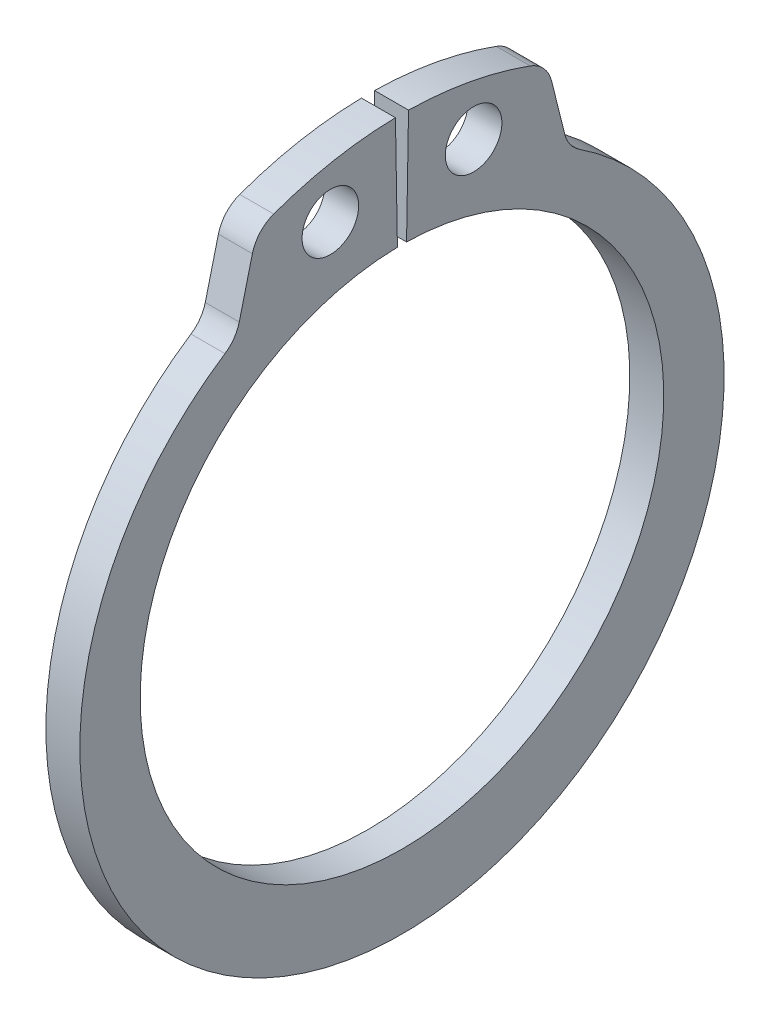
ISO-10303-21;
HEADER;
FILE_DESCRIPTION(('STEP AP214'),'2;1');
FILE_NAME('part.step','',(''),(''),'','','');
FILE_SCHEMA(('AUTOMOTIVE_DESIGN { 1 0 10303 214 1 1 1 1 }'));
ENDSEC;
DATA;
#1=APPLICATION_CONTEXT('core data for automotive mechanical design processes');
#2=APPLICATION_PROTOCOL_DEFINITION('international standard','automotive_design',2000,#1);
#3=PRODUCT_CONTEXT('',#1,'mechanical');
#4=PRODUCT('Part','Part','',(#3));
#5=PRODUCT_RELATED_PRODUCT_CATEGORY('part','',(#4));
#6=PRODUCT_DEFINITION_FORMATION('','',#4);
#7=PRODUCT_DEFINITION_CONTEXT('part definition',#1,'design');
#8=PRODUCT_DEFINITION('design','',#6,#7);
#9=PRODUCT_DEFINITION_SHAPE('','',#8);
#10=(LENGTH_UNIT() NAMED_UNIT(*) SI_UNIT(.MILLI.,.METRE.));
#11=(NAMED_UNIT(*) PLANE_ANGLE_UNIT() SI_UNIT($,.RADIAN.));
#12=(NAMED_UNIT(*) SI_UNIT($,.STERADIAN.) SOLID_ANGLE_UNIT());
#13=UNCERTAINTY_MEASURE_WITH_UNIT(LENGTH_MEASURE(1.E-05),#10,'distance_accuracy_value','');
#14=(GEOMETRIC_REPRESENTATION_CONTEXT(3) GLOBAL_UNCERTAINTY_ASSIGNED_CONTEXT((#13)) GLOBAL_UNIT_ASSIGNED_CONTEXT((#10,
#11,#12)) REPRESENTATION_CONTEXT('',''));
#15=CARTESIAN_POINT('',(0.,0.,0.));
#16=DIRECTION('',(0.,0.,1.));
#17=DIRECTION('',(1.,0.,0.));
#18=AXIS2_PLACEMENT_3D('',#15,#16,#17);
#19=CARTESIAN_POINT('',(0.600000000000003,0.,0.));
#20=DIRECTION('',(1.,0.,0.));
#21=DIRECTION('',(0.,0.,-1.00000000000001));
#22=AXIS2_PLACEMENT_3D('',#19,#20,#21);
#23=PLANE('',#22);
#24=CARTESIAN_POINT('',(0.600000000000003,11.2075498339009,2.53014564968777));
#25=DIRECTION('',(1.,0.,0.));
#26=DIRECTION('',(0.,0.,-1.00000000000001));
#27=AXIS2_PLACEMENT_3D('',#24,#25,#26);
#28=CIRCLE('',#27,1.);
#29=CARTESIAN_POINT('',(0.600000000000003,11.2075498339009,1.53014564968776));
#30=VERTEX_POINT('',#29);
#31=EDGE_CURVE('E265',#30,#30,#28,.T.);
#32=ORIENTED_EDGE('',*,*,#31,.F.);
#33=EDGE_LOOP('',(#32));
#34=FACE_BOUND('',#33,.T.);
#35=CARTESIAN_POINT('',(0.600000000000003,0.,0.));
#36=DIRECTION('',(1.,0.,0.));
#37=DIRECTION('',(0.,0.,-1.00000000000001));
#38=AXIS2_PLACEMENT_3D('',#35,#36,#37);
#39=CIRCLE('',#38,13.25);
#40=CARTESIAN_POINT('',(0.600000000000003,13.2479819608223,0.231244385294014));
#41=VERTEX_POINT('',#40);
#42=CARTESIAN_POINT('',(0.600000000000003,12.4507767148436,4.53218040209242));
#43=VERTEX_POINT('',#42);
#44=EDGE_CURVE('E155',#41,#43,#39,.T.);
#45=ORIENTED_EDGE('',*,*,#44,.T.);
#46=CARTESIAN_POINT('',(0.600000000000003,11.3231592010465,4.12171878077085));
#47=DIRECTION('',(1.,0.,0.));
#48=DIRECTION('',(0.,0.,-1.00000000000001));
#49=AXIS2_PLACEMENT_3D('',#46,#47,#48);
#50=CIRCLE('',#49,1.2);
#51=CARTESIAN_POINT('',(0.600000000000003,11.6134654757661,5.28607365230206));
#52=VERTEX_POINT('',#51);
#53=EDGE_CURVE('E204',#43,#52,#50,.T.);
#54=ORIENTED_EDGE('',*,*,#53,.T.);
#55=DIRECTION('',(0.,-0.970295726276004,0.241921895599667));
#56=VECTOR('',#55,1.);
#57=CARTESIAN_POINT('',(0.600000000000003,12.2139395720066,5.13635864512735));
#58=LINE('',#57,#56);
#59=CARTESIAN_POINT('',(0.600000000000003,9.75327839740813,5.74987038146372));
#60=VERTEX_POINT('',#59);
#61=EDGE_CURVE('E255',#52,#60,#58,.T.);
#62=ORIENTED_EDGE('',*,*,#61,.T.);
#63=CARTESIAN_POINT('',(0.600000000000003,10.0435846721277,6.91422525299493));
#64=DIRECTION('',(1.,0.,0.));
#65=DIRECTION('',(0.,0.,-1.00000000000001));
#66=AXIS2_PLACEMENT_3D('',#63,#64,#65);
#67=CIRCLE('',#66,1.2);
#68=CARTESIAN_POINT('',(0.600000000000003,9.04102340024942,6.25477783573579));
#69=VERTEX_POINT('',#68);
#70=EDGE_CURVE('E220',#60,#69,#67,.F.);
#71=ORIENTED_EDGE('',*,*,#70,.T.);
#72=CARTESIAN_POINT('',(0.600000000000003,-0.468147245038732,0.));
#73=DIRECTION('',(1.,0.,0.));
#74=DIRECTION('',(0.,0.,-1.00000000000001));
#75=AXIS2_PLACEMENT_3D('',#72,#73,#74);
#76=CIRCLE('',#75,11.3818527549613);
#77=CARTESIAN_POINT('',(0.600000000000003,9.04102340024941,-6.25477783573582));
#78=VERTEX_POINT('',#77);
#79=EDGE_CURVE('E246',#69,#78,#76,.T.);
#80=ORIENTED_EDGE('',*,*,#79,.T.);
#81=CARTESIAN_POINT('',(0.600000000000003,10.0435846721277,-6.91422525299495));
#82=DIRECTION('',(1.,0.,0.));
#83=DIRECTION('',(0.,0.,-1.00000000000001));
#84=AXIS2_PLACEMENT_3D('',#81,#82,#83);
#85=CIRCLE('',#84,1.2);
#86=CARTESIAN_POINT('',(0.600000000000003,9.75327839740813,-5.74987038146375));
#87=VERTEX_POINT('',#86);
#88=EDGE_CURVE('E13',#78,#87,#85,.F.);
#89=ORIENTED_EDGE('',*,*,#88,.T.);
#90=DIRECTION('',(0.,0.970295726276004,0.241921895599668));
#91=VECTOR('',#90,1.);
#92=CARTESIAN_POINT('',(0.600000000000003,12.2139395720066,-5.13635864512737));
#93=LINE('',#92,#91);
#94=CARTESIAN_POINT('',(0.600000000000003,11.6134654757661,-5.28607365230208));
#95=VERTEX_POINT('',#94);
#96=EDGE_CURVE('E245',#87,#95,#93,.T.);
#97=ORIENTED_EDGE('',*,*,#96,.T.);
#98=CARTESIAN_POINT('',(0.600000000000003,11.3231592010465,-4.12171878077087));
#99=DIRECTION('',(1.,0.,0.));
#100=DIRECTION('',(0.,0.,-1.00000000000001));
#101=AXIS2_PLACEMENT_3D('',#98,#99,#100);
#102=CIRCLE('',#101,1.2);
#103=CARTESIAN_POINT('',(0.600000000000003,12.4507767148436,-4.53218040209245));
#104=VERTEX_POINT('',#103);
#105=EDGE_CURVE('E69',#95,#104,#102,.T.);
#106=ORIENTED_EDGE('',*,*,#105,.T.);
#107=CARTESIAN_POINT('',(0.600000000000003,0.,0.));
#108=DIRECTION('',(1.,0.,0.));
#109=DIRECTION('',(0.,0.,1.00000000000001));
#110=AXIS2_PLACEMENT_3D('',#107,#108,#109);
#111=CIRCLE('',#110,13.25);
#112=CARTESIAN_POINT('',(0.600000000000003,13.2479819608223,-0.231244385294005));
#113=VERTEX_POINT('',#112);
#114=EDGE_CURVE('E249',#104,#113,#111,.T.);
#115=ORIENTED_EDGE('',*,*,#114,.T.);
#116=DIRECTION('',(0.,-0.999847695156399,0.0174524064372832));
#117=VECTOR('',#116,1.);
#118=CARTESIAN_POINT('',(0.600000000000003,13.2479819608223,-0.231244385294002));
#119=LINE('',#118,#117);
#120=CARTESIAN_POINT('',(0.600000000000003,9.24859118019669,-0.161434759544873));
#121=VERTEX_POINT('',#120);
#122=EDGE_CURVE('E161',#113,#121,#119,.T.);
#123=ORIENTED_EDGE('',*,*,#122,.T.);
#124=CARTESIAN_POINT('',(0.600000000000003,0.,0.));
#125=DIRECTION('',(-1.,0.,0.));
#126=DIRECTION('',(0.,0.,-1.00000000000001));
#127=AXIS2_PLACEMENT_3D('',#124,#125,#126);
#128=CIRCLE('',#127,9.25);
#129=CARTESIAN_POINT('',(0.600000000000003,9.24859118019671,0.161434759544873));
#130=VERTEX_POINT('',#129);
#131=EDGE_CURVE('E156',#121,#130,#128,.T.);
#132=ORIENTED_EDGE('',*,*,#131,.T.);
#133=DIRECTION('',(0.,0.999847695156398,0.0174524064372837));
#134=VECTOR('',#133,1.);
#135=CARTESIAN_POINT('',(0.600000000000003,9.24859118019671,0.161434759544873));
#136=LINE('',#135,#134);
#137=EDGE_CURVE('E144',#130,#41,#136,.T.);
#138=ORIENTED_EDGE('',*,*,#137,.T.);
#139=EDGE_LOOP('',(#45,#54,#62,#71,#80,#89,#97,#106,#115,#123,#132,#138));
#140=FACE_BOUND('',#139,.T.);
#141=CARTESIAN_POINT('',(0.600000000000003,11.2075498339009,-2.53014564968777));
#142=DIRECTION('',(1.,0.,0.));
#143=DIRECTION('',(0.,0.,-1.00000000000001));
#144=AXIS2_PLACEMENT_3D('',#141,#142,#143);
#145=CIRCLE('',#144,0.999999999999999);
#146=CARTESIAN_POINT('',(0.600000000000003,11.2075498339009,-3.53014564968777));
#147=VERTEX_POINT('',#146);
#148=EDGE_CURVE('E307',#147,#147,#145,.T.);
#149=ORIENTED_EDGE('',*,*,#148,.F.);
#150=EDGE_LOOP('',(#149));
#151=FACE_BOUND('',#150,.T.);
#152=ADVANCED_FACE('F53',(#34,#140,#151),#23,.T.);
#153=CARTESIAN_POINT('',(-0.600000000000003,0.,0.));
#154=DIRECTION('',(1.,0.,0.));
#155=DIRECTION('',(0.,0.,-1.00000000000001));
#156=AXIS2_PLACEMENT_3D('',#153,#154,#155);
#157=PLANE('',#156);
#158=CARTESIAN_POINT('',(-0.600000000000003,11.2075498339009,2.53014564968777));
#159=DIRECTION('',(1.,0.,0.));
#160=DIRECTION('',(0.,0.,-1.00000000000001));
#161=AXIS2_PLACEMENT_3D('',#158,#159,#160);
#162=CIRCLE('',#161,1.);
#163=CARTESIAN_POINT('',(-0.600000000000003,11.2075498339009,1.53014564968776));
#164=VERTEX_POINT('',#163);
#165=EDGE_CURVE('E303',#164,#164,#162,.T.);
#166=ORIENTED_EDGE('',*,*,#165,.T.);
#167=EDGE_LOOP('',(#166));
#168=FACE_BOUND('',#167,.T.);
#169=DIRECTION('',(0.,-0.970295726276004,0.241921895599667));
#170=VECTOR('',#169,1.);
#171=CARTESIAN_POINT('',(-0.600000000000003,12.2139395720066,5.13635864512735));
#172=LINE('',#171,#170);
#173=CARTESIAN_POINT('',(-0.600000000000003,11.6134654757661,5.28607365230206));
#174=VERTEX_POINT('',#173);
#175=CARTESIAN_POINT('',(-0.600000000000003,9.75327839740814,5.74987038146373));
#176=VERTEX_POINT('',#175);
#177=EDGE_CURVE('E242',#174,#176,#172,.T.);
#178=ORIENTED_EDGE('',*,*,#177,.F.);
#179=CARTESIAN_POINT('',(-0.600000000000003,11.3231592010465,4.12171878077085));
#180=DIRECTION('',(1.,0.,0.));
#181=DIRECTION('',(0.,0.,-1.00000000000001));
#182=AXIS2_PLACEMENT_3D('',#179,#180,#181);
#183=CIRCLE('',#182,1.2);
#184=CARTESIAN_POINT('',(-0.600000000000003,12.4507767148436,4.53218040209242));
#185=VERTEX_POINT('',#184);
#186=EDGE_CURVE('E196',#174,#185,#183,.F.);
#187=ORIENTED_EDGE('',*,*,#186,.T.);
#188=CARTESIAN_POINT('',(-0.600000000000003,0.,0.));
#189=DIRECTION('',(1.,0.,0.));
#190=DIRECTION('',(0.,0.,-1.00000000000001));
#191=AXIS2_PLACEMENT_3D('',#188,#189,#190);
#192=CIRCLE('',#191,13.25);
#193=CARTESIAN_POINT('',(-0.600000000000003,13.2479819608223,0.231244385294007));
#194=VERTEX_POINT('',#193);
#195=EDGE_CURVE('E268',#194,#185,#192,.T.);
#196=ORIENTED_EDGE('',*,*,#195,.F.);
#197=DIRECTION('',(0.,0.999847695156398,0.0174524064372837));
#198=VECTOR('',#197,1.);
#199=CARTESIAN_POINT('',(-0.600000000000003,9.24859118019671,0.161434759544874));
#200=LINE('',#199,#198);
#201=CARTESIAN_POINT('',(-0.600000000000003,9.24859118019671,0.161434759544874));
#202=VERTEX_POINT('',#201);
#203=EDGE_CURVE('E264',#202,#194,#200,.T.);
#204=ORIENTED_EDGE('',*,*,#203,.F.);
#205=CARTESIAN_POINT('',(-0.600000000000003,0.,0.));
#206=DIRECTION('',(-1.,0.,0.));
#207=DIRECTION('',(0.,0.,-1.00000000000001));
#208=AXIS2_PLACEMENT_3D('',#205,#206,#207);
#209=CIRCLE('',#208,9.25);
#210=CARTESIAN_POINT('',(-0.600000000000003,9.24859118019669,-0.161434759544872));
#211=VERTEX_POINT('',#210);
#212=EDGE_CURVE('E170',#211,#202,#209,.T.);
#213=ORIENTED_EDGE('',*,*,#212,.F.);
#214=DIRECTION('',(0.,-0.999847695156399,0.0174524064372832));
#215=VECTOR('',#214,1.);
#216=CARTESIAN_POINT('',(-0.600000000000003,13.2479819608223,-0.23124438529401));
#217=LINE('',#216,#215);
#218=CARTESIAN_POINT('',(-0.600000000000003,13.2479819608223,-0.231244385294011));
#219=VERTEX_POINT('',#218);
#220=EDGE_CURVE('E166',#219,#211,#217,.T.);
#221=ORIENTED_EDGE('',*,*,#220,.F.);
#222=CARTESIAN_POINT('',(-0.600000000000003,0.,0.));
#223=DIRECTION('',(1.,0.,0.));
#224=DIRECTION('',(0.,0.,1.00000000000001));
#225=AXIS2_PLACEMENT_3D('',#222,#223,#224);
#226=CIRCLE('',#225,13.25);
#227=CARTESIAN_POINT('',(-0.600000000000003,12.4507767148436,-4.53218040209245));
#228=VERTEX_POINT('',#227);
#229=EDGE_CURVE('E277',#228,#219,#226,.T.);
#230=ORIENTED_EDGE('',*,*,#229,.F.);
#231=CARTESIAN_POINT('',(-0.600000000000003,11.3231592010465,-4.12171878077087));
#232=DIRECTION('',(1.,0.,0.));
#233=DIRECTION('',(0.,0.,-1.00000000000001));
#234=AXIS2_PLACEMENT_3D('',#231,#232,#233);
#235=CIRCLE('',#234,1.2);
#236=CARTESIAN_POINT('',(-0.600000000000003,11.6134654757661,-5.28607365230208));
#237=VERTEX_POINT('',#236);
#238=EDGE_CURVE('E193',#228,#237,#235,.F.);
#239=ORIENTED_EDGE('',*,*,#238,.T.);
#240=DIRECTION('',(0.,0.970295726276004,0.241921895599668));
#241=VECTOR('',#240,1.);
#242=CARTESIAN_POINT('',(-0.600000000000003,12.2139395720066,-5.13635864512737));
#243=LINE('',#242,#241);
#244=CARTESIAN_POINT('',(-0.600000000000003,9.75327839740813,-5.74987038146374));
#245=VERTEX_POINT('',#244);
#246=EDGE_CURVE('E232',#245,#237,#243,.T.);
#247=ORIENTED_EDGE('',*,*,#246,.F.);
#248=CARTESIAN_POINT('',(-0.600000000000003,10.0435846721277,-6.91422525299494));
#249=DIRECTION('',(1.,0.,0.));
#250=DIRECTION('',(0.,0.,-1.00000000000001));
#251=AXIS2_PLACEMENT_3D('',#248,#249,#250);
#252=CIRCLE('',#251,1.2);
#253=CARTESIAN_POINT('',(-0.600000000000003,9.04102340024941,-6.25477783573581));
#254=VERTEX_POINT('',#253);
#255=EDGE_CURVE('E62',#245,#254,#252,.T.);
#256=ORIENTED_EDGE('',*,*,#255,.T.);
#257=CARTESIAN_POINT('',(-0.600000000000003,-0.468147245038732,0.));
#258=DIRECTION('',(1.,0.,0.));
#259=DIRECTION('',(0.,0.,-1.00000000000001));
#260=AXIS2_PLACEMENT_3D('',#257,#258,#259);
#261=CIRCLE('',#260,11.3818527549613);
#262=CARTESIAN_POINT('',(-0.600000000000003,9.04102340024941,6.2547778357358));
#263=VERTEX_POINT('',#262);
#264=EDGE_CURVE('E231',#263,#254,#261,.T.);
#265=ORIENTED_EDGE('',*,*,#264,.F.);
#266=CARTESIAN_POINT('',(-0.600000000000003,10.0435846721277,6.91422525299493));
#267=DIRECTION('',(1.,0.,0.));
#268=DIRECTION('',(0.,0.,-1.00000000000001));
#269=AXIS2_PLACEMENT_3D('',#266,#267,#268);
#270=CIRCLE('',#269,1.2);
#271=EDGE_CURVE('E217',#263,#176,#270,.T.);
#272=ORIENTED_EDGE('',*,*,#271,.T.);
#273=EDGE_LOOP('',(#178,#187,#196,#204,#213,#221,#230,#239,#247,#256,#265,#272));
#274=FACE_BOUND('',#273,.T.);
#275=CARTESIAN_POINT('',(-0.600000000000003,11.2075498339009,-2.53014564968777));
#276=DIRECTION('',(1.,0.,0.));
#277=DIRECTION('',(0.,0.,-1.00000000000001));
#278=AXIS2_PLACEMENT_3D('',#275,#276,#277);
#279=CIRCLE('',#278,0.999999999999999);
#280=CARTESIAN_POINT('',(-0.600000000000003,11.2075498339009,-3.53014564968778));
#281=VERTEX_POINT('',#280);
#282=EDGE_CURVE('E311',#281,#281,#279,.T.);
#283=ORIENTED_EDGE('',*,*,#282,.T.);
#284=EDGE_LOOP('',(#283));
#285=FACE_BOUND('',#284,.T.);
#286=ADVANCED_FACE('F229',(#168,#274,#285),#157,.F.);
#287=CARTESIAN_POINT('',(0.600000000000003,0.,0.));
#288=DIRECTION('',(-1.,0.,0.));
#289=DIRECTION('',(0.,0.,1.00000000000001));
#290=AXIS2_PLACEMENT_3D('',#287,#288,#289);
#291=CYLINDRICAL_SURFACE('',#290,9.25);
#292=ORIENTED_EDGE('',*,*,#212,.T.);
#293=DIRECTION('',(-1.,0.,0.));
#294=VECTOR('',#293,1.);
#295=CARTESIAN_POINT('',(0.600000000000003,9.24859118019671,0.161434759544873));
#296=LINE('',#295,#294);
#297=EDGE_CURVE('E148',#130,#202,#296,.T.);
#298=ORIENTED_EDGE('',*,*,#297,.F.);
#299=ORIENTED_EDGE('',*,*,#131,.F.);
#300=DIRECTION('',(-1.,0.,0.));
#301=VECTOR('',#300,1.);
#302=CARTESIAN_POINT('',(0.600000000000003,9.24859118019669,-0.161434759544873));
#303=LINE('',#302,#301);
#304=EDGE_CURVE('E261',#121,#211,#303,.T.);
#305=ORIENTED_EDGE('',*,*,#304,.T.);
#306=EDGE_LOOP('',(#292,#298,#299,#305));
#307=FACE_BOUND('',#306,.T.);
#308=ADVANCED_FACE('F168',(#307),#291,.F.);
#309=CARTESIAN_POINT('',(0.600000000000003,9.24859118019671,0.161434759544873));
#310=DIRECTION('',(0.,-0.0174524064372837,0.999847695156398));
#311=DIRECTION('',(0.,-0.999847695156398,-0.0174524064372837));
#312=AXIS2_PLACEMENT_3D('',#309,#310,#311);
#313=PLANE('',#312);
#314=ORIENTED_EDGE('',*,*,#203,.T.);
#315=DIRECTION('',(-1.,0.,0.));
#316=VECTOR('',#315,1.);
#317=CARTESIAN_POINT('',(0.600000000000003,13.2479819608223,0.231244385294014));
#318=LINE('',#317,#316);
#319=EDGE_CURVE('E151',#41,#194,#318,.T.);
#320=ORIENTED_EDGE('',*,*,#319,.F.);
#321=ORIENTED_EDGE('',*,*,#137,.F.);
#322=ORIENTED_EDGE('',*,*,#297,.T.);
#323=EDGE_LOOP('',(#314,#320,#321,#322));
#324=FACE_BOUND('',#323,.T.);
#325=ADVANCED_FACE('F146',(#324),#313,.F.);
#326=CARTESIAN_POINT('',(0.600000000000003,0.,0.));
#327=DIRECTION('',(-1.,0.,0.));
#328=DIRECTION('',(0.,0.,1.00000000000001));
#329=AXIS2_PLACEMENT_3D('',#326,#327,#328);
#330=CYLINDRICAL_SURFACE('',#329,13.25);
#331=ORIENTED_EDGE('',*,*,#195,.T.);
#332=DIRECTION('',(-1.,0.,0.));
#333=VECTOR('',#332,1.);
#334=CARTESIAN_POINT('',(0.600000000000003,12.4507767148436,4.53218040209242));
#335=LINE('',#334,#333);
#336=EDGE_CURVE('E199',#185,#43,#335,.F.);
#337=ORIENTED_EDGE('',*,*,#336,.T.);
#338=ORIENTED_EDGE('',*,*,#44,.F.);
#339=ORIENTED_EDGE('',*,*,#319,.T.);
#340=EDGE_LOOP('',(#331,#337,#338,#339));
#341=FACE_BOUND('',#340,.T.);
#342=ADVANCED_FACE('F294',(#341),#330,.T.);
#343=CARTESIAN_POINT('',(0.600000000000003,12.2139395720066,5.13635864512735));
#344=DIRECTION('',(0.,-0.241921895599667,-0.970295726276004));
#345=DIRECTION('',(0.,0.970295726276004,-0.241921895599667));
#346=AXIS2_PLACEMENT_3D('',#343,#344,#345);
#347=PLANE('',#346);
#348=ORIENTED_EDGE('',*,*,#177,.T.);
#349=DIRECTION('',(1.,0.,0.));
#350=VECTOR('',#349,1.);
#351=CARTESIAN_POINT('',(0.600000000000003,9.75327839740813,5.74987038146372));
#352=LINE('',#351,#350);
#353=EDGE_CURVE('E190',#176,#60,#352,.T.);
#354=ORIENTED_EDGE('',*,*,#353,.T.);
#355=ORIENTED_EDGE('',*,*,#61,.F.);
#356=DIRECTION('',(-1.,0.,0.));
#357=VECTOR('',#356,1.);
#358=CARTESIAN_POINT('',(0.600000000000003,11.6134654757661,5.28607365230206));
#359=LINE('',#358,#357);
#360=EDGE_CURVE('E186',#52,#174,#359,.T.);
#361=ORIENTED_EDGE('',*,*,#360,.T.);
#362=EDGE_LOOP('',(#348,#354,#355,#361));
#363=FACE_BOUND('',#362,.T.);
#364=ADVANCED_FACE('F344',(#363),#347,.F.);
#365=CARTESIAN_POINT('',(0.600000000000003,-0.468147245038732,0.));
#366=DIRECTION('',(-1.,0.,0.));
#367=DIRECTION('',(0.,0.,1.00000000000001));
#368=AXIS2_PLACEMENT_3D('',#365,#366,#367);
#369=CYLINDRICAL_SURFACE('',#368,11.3818527549613);
#370=ORIENTED_EDGE('',*,*,#79,.F.);
#371=DIRECTION('',(-1.,0.,0.));
#372=VECTOR('',#371,1.);
#373=CARTESIAN_POINT('',(0.600000000000003,9.04102340024942,6.25477783573579));
#374=LINE('',#373,#372);
#375=EDGE_CURVE('E177',#69,#263,#374,.T.);
#376=ORIENTED_EDGE('',*,*,#375,.T.);
#377=ORIENTED_EDGE('',*,*,#264,.T.);
#378=DIRECTION('',(-1.,0.,0.));
#379=VECTOR('',#378,1.);
#380=CARTESIAN_POINT('',(0.600000000000003,9.04102340024941,-6.25477783573582));
#381=LINE('',#380,#379);
#382=EDGE_CURVE('E172',#254,#78,#381,.F.);
#383=ORIENTED_EDGE('',*,*,#382,.T.);
#384=EDGE_LOOP('',(#370,#376,#377,#383));
#385=FACE_BOUND('',#384,.T.);
#386=ADVANCED_FACE('F238',(#385),#369,.T.);
#387=CARTESIAN_POINT('',(0.600000000000003,12.2139395720066,-5.13635864512737));
#388=DIRECTION('',(0.,-0.241921895599668,0.970295726276004));
#389=DIRECTION('',(0.,-0.970295726276004,-0.241921895599668));
#390=AXIS2_PLACEMENT_3D('',#387,#388,#389);
#391=PLANE('',#390);
#392=ORIENTED_EDGE('',*,*,#246,.T.);
#393=DIRECTION('',(-1.,0.,0.));
#394=VECTOR('',#393,1.);
#395=CARTESIAN_POINT('',(0.600000000000003,11.6134654757661,-5.28607365230208));
#396=LINE('',#395,#394);
#397=EDGE_CURVE('E77',#237,#95,#396,.F.);
#398=ORIENTED_EDGE('',*,*,#397,.T.);
#399=ORIENTED_EDGE('',*,*,#96,.F.);
#400=DIRECTION('',(1.,0.,0.));
#401=VECTOR('',#400,1.);
#402=CARTESIAN_POINT('',(-0.600000000000003,9.75327839740814,-5.74987038146374));
#403=LINE('',#402,#401);
#404=EDGE_CURVE('E211',#87,#245,#403,.F.);
#405=ORIENTED_EDGE('',*,*,#404,.T.);
#406=EDGE_LOOP('',(#392,#398,#399,#405));
#407=FACE_BOUND('',#406,.T.);
#408=ADVANCED_FACE('F247',(#407),#391,.F.);
#409=CARTESIAN_POINT('',(0.600000000000003,0.,0.));
#410=DIRECTION('',(-1.,0.,0.));
#411=DIRECTION('',(0.,0.,1.00000000000001));
#412=AXIS2_PLACEMENT_3D('',#409,#410,#411);
#413=CYLINDRICAL_SURFACE('',#412,13.25);
#414=ORIENTED_EDGE('',*,*,#114,.F.);
#415=DIRECTION('',(-1.,0.,0.));
#416=VECTOR('',#415,1.);
#417=CARTESIAN_POINT('',(0.600000000000003,12.4507767148436,-4.53218040209245));
#418=LINE('',#417,#416);
#419=EDGE_CURVE('E207',#104,#228,#418,.T.);
#420=ORIENTED_EDGE('',*,*,#419,.T.);
#421=ORIENTED_EDGE('',*,*,#229,.T.);
#422=DIRECTION('',(-1.,0.,0.));
#423=VECTOR('',#422,1.);
#424=CARTESIAN_POINT('',(0.600000000000003,13.2479819608223,-0.231244385294005));
#425=LINE('',#424,#423);
#426=EDGE_CURVE('E179',#113,#219,#425,.T.);
#427=ORIENTED_EDGE('',*,*,#426,.F.);
#428=EDGE_LOOP('',(#414,#420,#421,#427));
#429=FACE_BOUND('',#428,.T.);
#430=ADVANCED_FACE('F337',(#429),#413,.T.);
#431=CARTESIAN_POINT('',(0.600000000000003,13.2479819608223,-0.231244385294002));
#432=DIRECTION('',(0.,-0.0174524064372833,-0.999847695156398));
#433=DIRECTION('',(0.,0.999847695156398,-0.0174524064372833));
#434=AXIS2_PLACEMENT_3D('',#431,#432,#433);
#435=PLANE('',#434);
#436=ORIENTED_EDGE('',*,*,#220,.T.);
#437=ORIENTED_EDGE('',*,*,#304,.F.);
#438=ORIENTED_EDGE('',*,*,#122,.F.);
#439=ORIENTED_EDGE('',*,*,#426,.T.);
#440=EDGE_LOOP('',(#436,#437,#438,#439));
#441=FACE_BOUND('',#440,.T.);
#442=ADVANCED_FACE('F289',(#441),#435,.F.);
#443=CARTESIAN_POINT('',(0.600000000000003,11.2075498339009,2.53014564968777));
#444=DIRECTION('',(-1.,0.,0.));
#445=DIRECTION('',(0.,0.,1.00000000000001));
#446=AXIS2_PLACEMENT_3D('',#443,#444,#445);
#447=CYLINDRICAL_SURFACE('',#446,1.);
#448=ORIENTED_EDGE('',*,*,#31,.T.);
#449=EDGE_LOOP('',(#448));
#450=FACE_BOUND('',#449,.T.);
#451=ORIENTED_EDGE('',*,*,#165,.F.);
#452=EDGE_LOOP('',(#451));
#453=FACE_BOUND('',#452,.T.);
#454=ADVANCED_FACE('F332',(#450,#453),#447,.F.);
#455=CARTESIAN_POINT('',(0.600000000000003,11.2075498339009,-2.53014564968777));
#456=DIRECTION('',(-1.,0.,0.));
#457=DIRECTION('',(0.,0.,1.00000000000001));
#458=AXIS2_PLACEMENT_3D('',#455,#456,#457);
#459=CYLINDRICAL_SURFACE('',#458,0.999999999999999);
#460=ORIENTED_EDGE('',*,*,#148,.T.);
#461=EDGE_LOOP('',(#460));
#462=FACE_BOUND('',#461,.T.);
#463=ORIENTED_EDGE('',*,*,#282,.F.);
#464=EDGE_LOOP('',(#463));
#465=FACE_BOUND('',#464,.T.);
#466=ADVANCED_FACE('F320',(#462,#465),#459,.F.);
#467=CARTESIAN_POINT('',(0.600000000000003,10.0435846721277,6.91422525299493));
#468=DIRECTION('',(-1.,0.,0.));
#469=DIRECTION('',(0.,0.,1.00000000000001));
#470=AXIS2_PLACEMENT_3D('',#467,#468,#469);
#471=CYLINDRICAL_SURFACE('',#470,1.2);
#472=ORIENTED_EDGE('',*,*,#70,.F.);
#473=ORIENTED_EDGE('',*,*,#353,.F.);
#474=ORIENTED_EDGE('',*,*,#271,.F.);
#475=ORIENTED_EDGE('',*,*,#375,.F.);
#476=EDGE_LOOP('',(#472,#473,#474,#475));
#477=FACE_BOUND('',#476,.T.);
#478=ADVANCED_FACE('F354',(#477),#471,.F.);
#479=CARTESIAN_POINT('',(0.600000000000003,11.3231592010465,4.12171878077085));
#480=DIRECTION('',(-1.,0.,0.));
#481=DIRECTION('',(0.,0.,1.00000000000001));
#482=AXIS2_PLACEMENT_3D('',#479,#480,#481);
#483=CYLINDRICAL_SURFACE('',#482,1.2);
#484=ORIENTED_EDGE('',*,*,#53,.F.);
#485=ORIENTED_EDGE('',*,*,#336,.F.);
#486=ORIENTED_EDGE('',*,*,#186,.F.);
#487=ORIENTED_EDGE('',*,*,#360,.F.);
#488=EDGE_LOOP('',(#484,#485,#486,#487));
#489=FACE_BOUND('',#488,.T.);
#490=ADVANCED_FACE('F357',(#489),#483,.T.);
#491=CARTESIAN_POINT('',(0.600000000000003,11.3231592010465,-4.12171878077087));
#492=DIRECTION('',(-1.,0.,0.));
#493=DIRECTION('',(0.,0.,1.00000000000001));
#494=AXIS2_PLACEMENT_3D('',#491,#492,#493);
#495=CYLINDRICAL_SURFACE('',#494,1.2);
#496=ORIENTED_EDGE('',*,*,#105,.F.);
#497=ORIENTED_EDGE('',*,*,#397,.F.);
#498=ORIENTED_EDGE('',*,*,#238,.F.);
#499=ORIENTED_EDGE('',*,*,#419,.F.);
#500=EDGE_LOOP('',(#496,#497,#498,#499));
#501=FACE_BOUND('',#500,.T.);
#502=ADVANCED_FACE('F360',(#501),#495,.T.);
#503=CARTESIAN_POINT('',(0.600000000000003,10.0435846721277,-6.91422525299495));
#504=DIRECTION('',(-1.,0.,0.));
#505=DIRECTION('',(0.,0.,1.00000000000001));
#506=AXIS2_PLACEMENT_3D('',#503,#504,#505);
#507=CYLINDRICAL_SURFACE('',#506,1.2);
#508=ORIENTED_EDGE('',*,*,#88,.F.);
#509=ORIENTED_EDGE('',*,*,#382,.F.);
#510=ORIENTED_EDGE('',*,*,#255,.F.);
#511=ORIENTED_EDGE('',*,*,#404,.F.);
#512=EDGE_LOOP('',(#508,#509,#510,#511));
#513=FACE_BOUND('',#512,.T.);
#514=ADVANCED_FACE('F55',(#513),#507,.F.);
#515=CLOSED_SHELL('',(#152,#286,#308,#325,#342,#364,#386,#408,#430,#442,#454,#466,#478,#490,
#502,#514));
#516=MANIFOLD_SOLID_BREP('B2',#515);
#517=ADVANCED_BREP_SHAPE_REPRESENTATION('',(#18,#516),#14);
#518=SHAPE_DEFINITION_REPRESENTATION(#9,#517);
ENDSEC;
END-ISO-10303-21;
